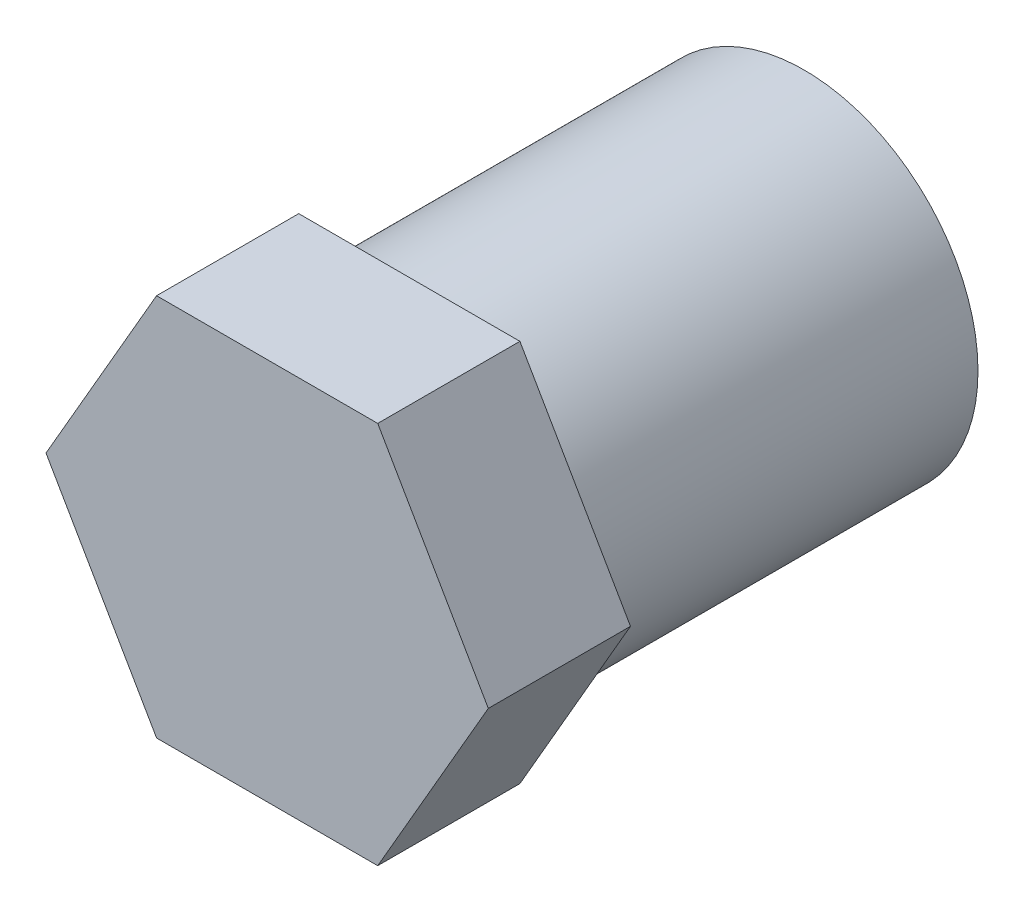
ISO-10303-21;
HEADER;
FILE_DESCRIPTION(('STEP AP214'),'2;1');
FILE_NAME('part.step','',(''),(''),'','','');
FILE_SCHEMA(('AUTOMOTIVE_DESIGN { 1 0 10303 214 1 1 1 1 }'));
ENDSEC;
DATA;
#1=APPLICATION_CONTEXT('core data for automotive mechanical design processes');
#2=APPLICATION_PROTOCOL_DEFINITION('international standard','automotive_design',2000,#1);
#3=PRODUCT_CONTEXT('',#1,'mechanical');
#4=PRODUCT('Part','Part','',(#3));
#5=PRODUCT_RELATED_PRODUCT_CATEGORY('part','',(#4));
#6=PRODUCT_DEFINITION_FORMATION('','',#4);
#7=PRODUCT_DEFINITION_CONTEXT('part definition',#1,'design');
#8=PRODUCT_DEFINITION('design','',#6,#7);
#9=PRODUCT_DEFINITION_SHAPE('','',#8);
#10=(LENGTH_UNIT() NAMED_UNIT(*) SI_UNIT(.MILLI.,.METRE.));
#11=(NAMED_UNIT(*) PLANE_ANGLE_UNIT() SI_UNIT($,.RADIAN.));
#12=(NAMED_UNIT(*) SI_UNIT($,.STERADIAN.) SOLID_ANGLE_UNIT());
#13=UNCERTAINTY_MEASURE_WITH_UNIT(LENGTH_MEASURE(1.E-05),#10,'distance_accuracy_value','');
#14=(GEOMETRIC_REPRESENTATION_CONTEXT(3) GLOBAL_UNCERTAINTY_ASSIGNED_CONTEXT((#13)) GLOBAL_UNIT_ASSIGNED_CONTEXT((#10,
#11,#12)) REPRESENTATION_CONTEXT('',''));
#15=CARTESIAN_POINT('',(0.,0.,0.));
#16=DIRECTION('',(0.,0.,1.));
#17=DIRECTION('',(1.,0.,0.));
#18=AXIS2_PLACEMENT_3D('',#15,#16,#17);
#19=CARTESIAN_POINT('',(0.,0.,0.));
#20=DIRECTION('',(0.,0.,1.));
#21=DIRECTION('',(1.,0.,0.));
#22=AXIS2_PLACEMENT_3D('',#19,#20,#21);
#23=PLANE('',#22);
#24=CARTESIAN_POINT('',(0.,0.,0.));
#25=DIRECTION('',(0.,0.,1.));
#26=DIRECTION('',(1.,0.,0.));
#27=AXIS2_PLACEMENT_3D('',#24,#25,#26);
#28=CIRCLE('',#27,5.5);
#29=CARTESIAN_POINT('',(5.5,0.,0.));
#30=VERTEX_POINT('',#29);
#31=EDGE_CURVE('E40',#30,#30,#28,.T.);
#32=ORIENTED_EDGE('',*,*,#31,.F.);
#33=EDGE_LOOP('',(#32));
#34=FACE_BOUND('',#33,.T.);
#35=CARTESIAN_POINT('',(0.,0.,0.));
#36=DIRECTION('',(0.,0.,1.));
#37=DIRECTION('',(1.,0.,0.));
#38=AXIS2_PLACEMENT_3D('',#35,#36,#37);
#39=CIRCLE('',#38,2.5);
#40=CARTESIAN_POINT('',(2.5,0.,0.));
#41=VERTEX_POINT('',#40);
#42=EDGE_CURVE('E144',#41,#41,#39,.T.);
#43=ORIENTED_EDGE('',*,*,#42,.T.);
#44=EDGE_LOOP('',(#43));
#45=FACE_BOUND('',#44,.T.);
#46=ADVANCED_FACE('F36',(#34,#45),#23,.F.);
#47=CARTESIAN_POINT('',(0.,0.,12.5));
#48=DIRECTION('',(0.,0.,-1.));
#49=DIRECTION('',(-1.,0.,0.));
#50=AXIS2_PLACEMENT_3D('',#47,#48,#49);
#51=CYLINDRICAL_SURFACE('',#50,5.5);
#52=CARTESIAN_POINT('',(0.,0.,12.5));
#53=DIRECTION('',(0.,0.,1.));
#54=DIRECTION('',(1.,0.,0.));
#55=AXIS2_PLACEMENT_3D('',#52,#53,#54);
#56=CIRCLE('',#55,5.5);
#57=CARTESIAN_POINT('',(5.5,0.,12.5));
#58=VERTEX_POINT('',#57);
#59=EDGE_CURVE('E11',#58,#58,#56,.T.);
#60=ORIENTED_EDGE('',*,*,#59,.F.);
#61=EDGE_LOOP('',(#60));
#62=FACE_BOUND('',#61,.T.);
#63=ORIENTED_EDGE('',*,*,#31,.T.);
#64=EDGE_LOOP('',(#63));
#65=FACE_BOUND('',#64,.T.);
#66=ADVANCED_FACE('F38',(#62,#65),#51,.T.);
#67=CARTESIAN_POINT('',(0.,0.,12.5));
#68=DIRECTION('',(0.,0.,-1.));
#69=DIRECTION('',(-1.,0.,0.));
#70=AXIS2_PLACEMENT_3D('',#67,#68,#69);
#71=CYLINDRICAL_SURFACE('',#70,2.5);
#72=CARTESIAN_POINT('',(0.,0.,12.5));
#73=DIRECTION('',(0.,0.,1.));
#74=DIRECTION('',(1.,0.,0.));
#75=AXIS2_PLACEMENT_3D('',#72,#73,#74);
#76=CIRCLE('',#75,2.5);
#77=CARTESIAN_POINT('',(2.5,0.,12.5));
#78=VERTEX_POINT('',#77);
#79=EDGE_CURVE('E141',#78,#78,#76,.T.);
#80=ORIENTED_EDGE('',*,*,#79,.T.);
#81=EDGE_LOOP('',(#80));
#82=FACE_BOUND('',#81,.T.);
#83=ORIENTED_EDGE('',*,*,#42,.F.);
#84=EDGE_LOOP('',(#83));
#85=FACE_BOUND('',#84,.T.);
#86=ADVANCED_FACE('F156',(#82,#85),#71,.F.);
#87=CARTESIAN_POINT('',(0.,0.,12.5));
#88=DIRECTION('',(0.,0.,1.));
#89=DIRECTION('',(1.,0.,0.));
#90=AXIS2_PLACEMENT_3D('',#87,#88,#89);
#91=PLANE('',#90);
#92=ORIENTED_EDGE('',*,*,#79,.F.);
#93=EDGE_LOOP('',(#92));
#94=FACE_BOUND('',#93,.T.);
#95=ADVANCED_FACE('F161',(#94),#91,.F.);
#96=CARTESIAN_POINT('',(-3.5,-6.06217782649108,17.));
#97=DIRECTION('',(0.,1.,0.));
#98=DIRECTION('',(-1.,0.,0.));
#99=AXIS2_PLACEMENT_3D('',#96,#97,#98);
#100=PLANE('',#99);
#101=DIRECTION('',(1.,0.,0.));
#102=VECTOR('',#101,1.);
#103=CARTESIAN_POINT('',(-3.5,-6.06217782649108,12.5));
#104=LINE('',#103,#102);
#105=CARTESIAN_POINT('',(-3.5,-6.06217782649108,12.5));
#106=VERTEX_POINT('',#105);
#107=CARTESIAN_POINT('',(3.5,-6.06217782649108,12.5));
#108=VERTEX_POINT('',#107);
#109=EDGE_CURVE('E122',#106,#108,#104,.T.);
#110=ORIENTED_EDGE('',*,*,#109,.T.);
#111=DIRECTION('',(0.,0.,-1.));
#112=VECTOR('',#111,1.);
#113=CARTESIAN_POINT('',(3.5,-6.06217782649108,17.));
#114=LINE('',#113,#112);
#115=CARTESIAN_POINT('',(3.5,-6.06217782649108,17.));
#116=VERTEX_POINT('',#115);
#117=EDGE_CURVE('E139',#116,#108,#114,.T.);
#118=ORIENTED_EDGE('',*,*,#117,.F.);
#119=DIRECTION('',(1.,0.,0.));
#120=VECTOR('',#119,1.);
#121=CARTESIAN_POINT('',(-3.5,-6.06217782649108,17.));
#122=LINE('',#121,#120);
#123=CARTESIAN_POINT('',(-3.5,-6.06217782649108,17.));
#124=VERTEX_POINT('',#123);
#125=EDGE_CURVE('E132',#124,#116,#122,.T.);
#126=ORIENTED_EDGE('',*,*,#125,.F.);
#127=DIRECTION('',(0.,0.,-1.));
#128=VECTOR('',#127,1.);
#129=CARTESIAN_POINT('',(-3.5,-6.06217782649108,17.));
#130=LINE('',#129,#128);
#131=EDGE_CURVE('E118',#124,#106,#130,.T.);
#132=ORIENTED_EDGE('',*,*,#131,.T.);
#133=EDGE_LOOP('',(#110,#118,#126,#132));
#134=FACE_BOUND('',#133,.T.);
#135=ADVANCED_FACE('F163',(#134),#100,.F.);
#136=CARTESIAN_POINT('',(3.5,-6.06217782649108,17.));
#137=DIRECTION('',(-0.86602540378444,0.499999999999998,0.));
#138=DIRECTION('',(-0.499999999999998,-0.86602540378444,0.));
#139=AXIS2_PLACEMENT_3D('',#136,#137,#138);
#140=PLANE('',#139);
#141=DIRECTION('',(0.499999999999998,0.86602540378444,0.));
#142=VECTOR('',#141,1.);
#143=CARTESIAN_POINT('',(3.5,-6.06217782649108,12.5));
#144=LINE('',#143,#142);
#145=CARTESIAN_POINT('',(6.99999999999998,0.,12.5));
#146=VERTEX_POINT('',#145);
#147=EDGE_CURVE('E125',#108,#146,#144,.T.);
#148=ORIENTED_EDGE('',*,*,#147,.T.);
#149=DIRECTION('',(0.,0.,-1.));
#150=VECTOR('',#149,1.);
#151=CARTESIAN_POINT('',(6.99999999999998,0.,17.));
#152=LINE('',#151,#150);
#153=CARTESIAN_POINT('',(6.99999999999998,0.,17.));
#154=VERTEX_POINT('',#153);
#155=EDGE_CURVE('E136',#154,#146,#152,.T.);
#156=ORIENTED_EDGE('',*,*,#155,.F.);
#157=DIRECTION('',(0.499999999999998,0.86602540378444,0.));
#158=VECTOR('',#157,1.);
#159=CARTESIAN_POINT('',(3.5,-6.06217782649108,17.));
#160=LINE('',#159,#158);
#161=EDGE_CURVE('E91',#116,#154,#160,.T.);
#162=ORIENTED_EDGE('',*,*,#161,.F.);
#163=ORIENTED_EDGE('',*,*,#117,.T.);
#164=EDGE_LOOP('',(#148,#156,#162,#163));
#165=FACE_BOUND('',#164,.T.);
#166=ADVANCED_FACE('F166',(#165),#140,.F.);
#167=CARTESIAN_POINT('',(3.5,6.06217782649108,17.));
#168=DIRECTION('',(-0.86602540378444,-0.499999999999998,0.));
#169=DIRECTION('',(0.499999999999998,-0.86602540378444,0.));
#170=AXIS2_PLACEMENT_3D('',#167,#168,#169);
#171=PLANE('',#170);
#172=DIRECTION('',(-0.499999999999998,0.86602540378444,0.));
#173=VECTOR('',#172,1.);
#174=CARTESIAN_POINT('',(3.5,6.06217782649108,12.5));
#175=LINE('',#174,#173);
#176=CARTESIAN_POINT('',(3.5,6.06217782649108,12.5));
#177=VERTEX_POINT('',#176);
#178=EDGE_CURVE('E127',#146,#177,#175,.T.);
#179=ORIENTED_EDGE('',*,*,#178,.T.);
#180=DIRECTION('',(0.,0.,-1.));
#181=VECTOR('',#180,1.);
#182=CARTESIAN_POINT('',(3.5,6.06217782649108,17.));
#183=LINE('',#182,#181);
#184=CARTESIAN_POINT('',(3.5,6.06217782649108,17.));
#185=VERTEX_POINT('',#184);
#186=EDGE_CURVE('E113',#185,#177,#183,.T.);
#187=ORIENTED_EDGE('',*,*,#186,.F.);
#188=DIRECTION('',(-0.499999999999998,0.86602540378444,0.));
#189=VECTOR('',#188,1.);
#190=CARTESIAN_POINT('',(3.5,6.06217782649108,17.));
#191=LINE('',#190,#189);
#192=EDGE_CURVE('E104',#154,#185,#191,.T.);
#193=ORIENTED_EDGE('',*,*,#192,.F.);
#194=ORIENTED_EDGE('',*,*,#155,.T.);
#195=EDGE_LOOP('',(#179,#187,#193,#194));
#196=FACE_BOUND('',#195,.T.);
#197=ADVANCED_FACE('F170',(#196),#171,.F.);
#198=CARTESIAN_POINT('',(-3.5,6.06217782649108,17.));
#199=DIRECTION('',(0.,-1.,0.));
#200=DIRECTION('',(0.,0.,-1.));
#201=AXIS2_PLACEMENT_3D('',#198,#199,#200);
#202=PLANE('',#201);
#203=DIRECTION('',(-1.,0.,0.));
#204=VECTOR('',#203,1.);
#205=CARTESIAN_POINT('',(-3.5,6.06217782649108,12.5));
#206=LINE('',#205,#204);
#207=CARTESIAN_POINT('',(-3.5,6.06217782649108,12.5));
#208=VERTEX_POINT('',#207);
#209=EDGE_CURVE('E112',#177,#208,#206,.T.);
#210=ORIENTED_EDGE('',*,*,#209,.T.);
#211=DIRECTION('',(0.,0.,-1.));
#212=VECTOR('',#211,1.);
#213=CARTESIAN_POINT('',(-3.5,6.06217782649108,17.));
#214=LINE('',#213,#212);
#215=CARTESIAN_POINT('',(-3.5,6.06217782649108,17.));
#216=VERTEX_POINT('',#215);
#217=EDGE_CURVE('E109',#216,#208,#214,.T.);
#218=ORIENTED_EDGE('',*,*,#217,.F.);
#219=DIRECTION('',(-1.,0.,0.));
#220=VECTOR('',#219,1.);
#221=CARTESIAN_POINT('',(-3.5,6.06217782649108,17.));
#222=LINE('',#221,#220);
#223=EDGE_CURVE('E98',#185,#216,#222,.T.);
#224=ORIENTED_EDGE('',*,*,#223,.F.);
#225=ORIENTED_EDGE('',*,*,#186,.T.);
#226=EDGE_LOOP('',(#210,#218,#224,#225));
#227=FACE_BOUND('',#226,.T.);
#228=ADVANCED_FACE('F110',(#227),#202,.F.);
#229=CARTESIAN_POINT('',(-3.5,6.06217782649108,17.));
#230=DIRECTION('',(0.86602540378444,-0.499999999999997,0.));
#231=DIRECTION('',(0.499999999999997,0.86602540378444,0.));
#232=AXIS2_PLACEMENT_3D('',#229,#230,#231);
#233=PLANE('',#232);
#234=DIRECTION('',(-0.499999999999997,-0.86602540378444,0.));
#235=VECTOR('',#234,1.);
#236=CARTESIAN_POINT('',(-3.5,6.06217782649108,12.5));
#237=LINE('',#236,#235);
#238=CARTESIAN_POINT('',(-6.99999999999998,0.,12.5));
#239=VERTEX_POINT('',#238);
#240=EDGE_CURVE('E76',#208,#239,#237,.T.);
#241=ORIENTED_EDGE('',*,*,#240,.T.);
#242=DIRECTION('',(0.,0.,-1.));
#243=VECTOR('',#242,1.);
#244=CARTESIAN_POINT('',(-6.99999999999998,0.,17.));
#245=LINE('',#244,#243);
#246=CARTESIAN_POINT('',(-6.99999999999998,0.,17.));
#247=VERTEX_POINT('',#246);
#248=EDGE_CURVE('E114',#247,#239,#245,.T.);
#249=ORIENTED_EDGE('',*,*,#248,.F.);
#250=DIRECTION('',(-0.499999999999997,-0.86602540378444,0.));
#251=VECTOR('',#250,1.);
#252=CARTESIAN_POINT('',(-3.5,6.06217782649108,17.));
#253=LINE('',#252,#251);
#254=EDGE_CURVE('E102',#216,#247,#253,.T.);
#255=ORIENTED_EDGE('',*,*,#254,.F.);
#256=ORIENTED_EDGE('',*,*,#217,.T.);
#257=EDGE_LOOP('',(#241,#249,#255,#256));
#258=FACE_BOUND('',#257,.T.);
#259=ADVANCED_FACE('F116',(#258),#233,.F.);
#260=CARTESIAN_POINT('',(-3.5,-6.06217782649108,17.));
#261=DIRECTION('',(0.86602540378444,0.499999999999998,0.));
#262=DIRECTION('',(-0.499999999999998,0.86602540378444,0.));
#263=AXIS2_PLACEMENT_3D('',#260,#261,#262);
#264=PLANE('',#263);
#265=DIRECTION('',(0.499999999999998,-0.86602540378444,0.));
#266=VECTOR('',#265,1.);
#267=CARTESIAN_POINT('',(-3.5,-6.06217782649108,12.5));
#268=LINE('',#267,#266);
#269=EDGE_CURVE('E82',#239,#106,#268,.T.);
#270=ORIENTED_EDGE('',*,*,#269,.T.);
#271=ORIENTED_EDGE('',*,*,#131,.F.);
#272=DIRECTION('',(0.499999999999998,-0.86602540378444,0.));
#273=VECTOR('',#272,1.);
#274=CARTESIAN_POINT('',(-3.5,-6.06217782649108,17.));
#275=LINE('',#274,#273);
#276=EDGE_CURVE('E53',#247,#124,#275,.T.);
#277=ORIENTED_EDGE('',*,*,#276,.F.);
#278=ORIENTED_EDGE('',*,*,#248,.T.);
#279=EDGE_LOOP('',(#270,#271,#277,#278));
#280=FACE_BOUND('',#279,.T.);
#281=ADVANCED_FACE('F178',(#280),#264,.F.);
#282=CARTESIAN_POINT('',(0.,0.,17.));
#283=DIRECTION('',(0.,0.,1.));
#284=DIRECTION('',(1.,0.,0.));
#285=AXIS2_PLACEMENT_3D('',#282,#283,#284);
#286=PLANE('',#285);
#287=ORIENTED_EDGE('',*,*,#125,.T.);
#288=ORIENTED_EDGE('',*,*,#161,.T.);
#289=ORIENTED_EDGE('',*,*,#192,.T.);
#290=ORIENTED_EDGE('',*,*,#223,.T.);
#291=ORIENTED_EDGE('',*,*,#254,.T.);
#292=ORIENTED_EDGE('',*,*,#276,.T.);
#293=EDGE_LOOP('',(#287,#288,#289,#290,#291,#292));
#294=FACE_BOUND('',#293,.T.);
#295=ADVANCED_FACE('F100',(#294),#286,.T.);
#296=ORIENTED_EDGE('',*,*,#59,.T.);
#297=EDGE_LOOP('',(#296));
#298=FACE_BOUND('',#297,.T.);
#299=ORIENTED_EDGE('',*,*,#109,.F.);
#300=ORIENTED_EDGE('',*,*,#269,.F.);
#301=ORIENTED_EDGE('',*,*,#240,.F.);
#302=ORIENTED_EDGE('',*,*,#209,.F.);
#303=ORIENTED_EDGE('',*,*,#178,.F.);
#304=ORIENTED_EDGE('',*,*,#147,.F.);
#305=EDGE_LOOP('',(#299,#300,#301,#302,#303,#304));
#306=FACE_BOUND('',#305,.T.);
#307=ADVANCED_FACE('F181',(#298,#306),#91,.F.);
#308=CLOSED_SHELL('',(#46,#66,#86,#95,#135,#166,#197,#228,#259,#281,#295,#307));
#309=MANIFOLD_SOLID_BREP('B2',#308);
#310=ADVANCED_BREP_SHAPE_REPRESENTATION('',(#18,#309),#14);
#311=SHAPE_DEFINITION_REPRESENTATION(#9,#310);
ENDSEC;
END-ISO-10303-21;
